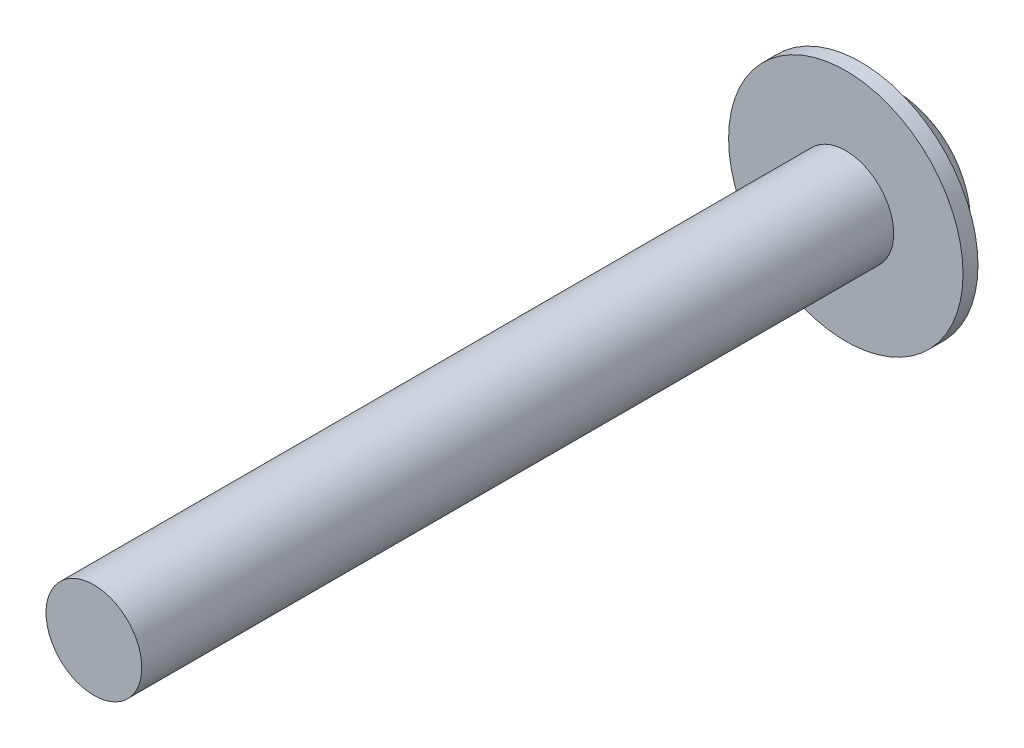
ISO-10303-21;
HEADER;
FILE_DESCRIPTION(('STEP AP214'),'2;1');
FILE_NAME('part.step','',(''),(''),'','','');
FILE_SCHEMA(('AUTOMOTIVE_DESIGN { 1 0 10303 214 1 1 1 1 }'));
ENDSEC;
DATA;
#1=APPLICATION_CONTEXT('core data for automotive mechanical design processes');
#2=APPLICATION_PROTOCOL_DEFINITION('international standard','automotive_design',2000,#1);
#3=PRODUCT_CONTEXT('',#1,'mechanical');
#4=PRODUCT('Part','Part','',(#3));
#5=PRODUCT_RELATED_PRODUCT_CATEGORY('part','',(#4));
#6=PRODUCT_DEFINITION_FORMATION('','',#4);
#7=PRODUCT_DEFINITION_CONTEXT('part definition',#1,'design');
#8=PRODUCT_DEFINITION('design','',#6,#7);
#9=PRODUCT_DEFINITION_SHAPE('','',#8);
#10=(LENGTH_UNIT() NAMED_UNIT(*) SI_UNIT(.MILLI.,.METRE.));
#11=(NAMED_UNIT(*) PLANE_ANGLE_UNIT() SI_UNIT($,.RADIAN.));
#12=(NAMED_UNIT(*) SI_UNIT($,.STERADIAN.) SOLID_ANGLE_UNIT());
#13=UNCERTAINTY_MEASURE_WITH_UNIT(LENGTH_MEASURE(1.E-05),#10,'distance_accuracy_value','');
#14=(GEOMETRIC_REPRESENTATION_CONTEXT(3) GLOBAL_UNCERTAINTY_ASSIGNED_CONTEXT((#13)) GLOBAL_UNIT_ASSIGNED_CONTEXT((#10,
#11,#12)) REPRESENTATION_CONTEXT('',''));
#15=CARTESIAN_POINT('',(0.,0.,0.));
#16=DIRECTION('',(0.,0.,1.));
#17=DIRECTION('',(1.,0.,0.));
#18=AXIS2_PLACEMENT_3D('',#15,#16,#17);
#19=CARTESIAN_POINT('',(0.,0.,-0.381));
#20=DIRECTION('',(0.,0.,-1.));
#21=DIRECTION('',(-1.,0.,0.));
#22=AXIS2_PLACEMENT_3D('',#19,#20,#21);
#23=PLANE('',#22);
#24=CARTESIAN_POINT('',(0.,0.,-0.381));
#25=DIRECTION('',(0.,0.,-1.));
#26=DIRECTION('',(-1.,0.,0.));
#27=AXIS2_PLACEMENT_3D('',#24,#25,#26);
#28=CIRCLE('',#27,2.9845);
#29=CARTESIAN_POINT('',(-2.9845,0.,-0.381));
#30=VERTEX_POINT('',#29);
#31=EDGE_CURVE('E50',#30,#30,#28,.T.);
#32=ORIENTED_EDGE('',*,*,#31,.T.);
#33=EDGE_LOOP('',(#32));
#34=FACE_BOUND('',#33,.T.);
#35=CARTESIAN_POINT('',(0.,0.,-0.381));
#36=DIRECTION('',(0.,0.,-1.));
#37=DIRECTION('',(-1.,0.,0.));
#38=AXIS2_PLACEMENT_3D('',#35,#36,#37);
#39=CIRCLE('',#38,2.2479);
#40=CARTESIAN_POINT('',(-2.2479,0.,-0.381));
#41=VERTEX_POINT('',#40);
#42=EDGE_CURVE('E54',#41,#41,#39,.T.);
#43=ORIENTED_EDGE('',*,*,#42,.F.);
#44=EDGE_LOOP('',(#43));
#45=FACE_BOUND('',#44,.T.);
#46=ADVANCED_FACE('F30',(#34,#45),#23,.T.);
#47=CARTESIAN_POINT('',(0.,0.,19.144));
#48=DIRECTION('',(0.,0.,-1.));
#49=DIRECTION('',(-1.,0.,0.));
#50=AXIS2_PLACEMENT_3D('',#47,#48,#49);
#51=CYLINDRICAL_SURFACE('',#50,1.2192);
#52=CARTESIAN_POINT('',(0.,0.,19.144));
#53=DIRECTION('',(0.,0.,1.));
#54=DIRECTION('',(1.,0.,0.));
#55=AXIS2_PLACEMENT_3D('',#52,#53,#54);
#56=CIRCLE('',#55,1.2192);
#57=CARTESIAN_POINT('',(1.2192,0.,19.144));
#58=VERTEX_POINT('',#57);
#59=EDGE_CURVE('E41',#58,#58,#56,.T.);
#60=ORIENTED_EDGE('',*,*,#59,.F.);
#61=EDGE_LOOP('',(#60));
#62=FACE_BOUND('',#61,.T.);
#63=CARTESIAN_POINT('',(0.,0.,0.));
#64=DIRECTION('',(0.,0.,-1.));
#65=DIRECTION('',(-1.,0.,0.));
#66=AXIS2_PLACEMENT_3D('',#63,#64,#65);
#67=CIRCLE('',#66,1.2192);
#68=CARTESIAN_POINT('',(-1.2192,0.,0.));
#69=VERTEX_POINT('',#68);
#70=EDGE_CURVE('E45',#69,#69,#67,.T.);
#71=ORIENTED_EDGE('',*,*,#70,.F.);
#72=EDGE_LOOP('',(#71));
#73=FACE_BOUND('',#72,.T.);
#74=ADVANCED_FACE('F63',(#62,#73),#51,.T.);
#75=CARTESIAN_POINT('',(0.,0.,19.144));
#76=DIRECTION('',(0.,0.,1.));
#77=DIRECTION('',(1.,0.,0.));
#78=AXIS2_PLACEMENT_3D('',#75,#76,#77);
#79=PLANE('',#78);
#80=ORIENTED_EDGE('',*,*,#59,.T.);
#81=EDGE_LOOP('',(#80));
#82=FACE_BOUND('',#81,.T.);
#83=ADVANCED_FACE('F69',(#82),#79,.T.);
#84=CARTESIAN_POINT('',(0.,0.,0.));
#85=DIRECTION('',(0.,0.,-1.));
#86=DIRECTION('',(-1.,0.,0.));
#87=AXIS2_PLACEMENT_3D('',#84,#85,#86);
#88=PLANE('',#87);
#89=CARTESIAN_POINT('',(0.,0.,0.));
#90=DIRECTION('',(0.,0.,-1.));
#91=DIRECTION('',(-1.,0.,0.));
#92=AXIS2_PLACEMENT_3D('',#89,#90,#91);
#93=CIRCLE('',#92,2.9845);
#94=CARTESIAN_POINT('',(-2.9845,0.,0.));
#95=VERTEX_POINT('',#94);
#96=EDGE_CURVE('E51',#95,#95,#93,.T.);
#97=ORIENTED_EDGE('',*,*,#96,.F.);
#98=EDGE_LOOP('',(#97));
#99=FACE_BOUND('',#98,.T.);
#100=ORIENTED_EDGE('',*,*,#70,.T.);
#101=EDGE_LOOP('',(#100));
#102=FACE_BOUND('',#101,.T.);
#103=ADVANCED_FACE('F74',(#99,#102),#88,.F.);
#104=CARTESIAN_POINT('',(0.,0.,-0.381));
#105=DIRECTION('',(0.,0.,1.));
#106=DIRECTION('',(1.,0.,0.));
#107=AXIS2_PLACEMENT_3D('',#104,#105,#106);
#108=CYLINDRICAL_SURFACE('',#107,2.9845);
#109=ORIENTED_EDGE('',*,*,#31,.F.);
#110=EDGE_LOOP('',(#109));
#111=FACE_BOUND('',#110,.T.);
#112=ORIENTED_EDGE('',*,*,#96,.T.);
#113=EDGE_LOOP('',(#112));
#114=FACE_BOUND('',#113,.T.);
#115=ADVANCED_FACE('F77',(#111,#114),#108,.T.);
#116=CARTESIAN_POINT('',(0.,0.,-1.524));
#117=DIRECTION('',(0.,0.,1.));
#118=DIRECTION('',(1.,0.,0.));
#119=AXIS2_PLACEMENT_3D('',#116,#117,#118);
#120=CYLINDRICAL_SURFACE('',#119,2.2479);
#121=CARTESIAN_POINT('',(0.,0.,-0.508));
#122=DIRECTION('',(0.,0.,-1.));
#123=DIRECTION('',(-1.,0.,0.));
#124=AXIS2_PLACEMENT_3D('',#121,#122,#123);
#125=CIRCLE('',#124,2.2479);
#126=CARTESIAN_POINT('',(-2.2479,0.,-0.508));
#127=VERTEX_POINT('',#126);
#128=EDGE_CURVE('E10',#127,#127,#125,.F.);
#129=ORIENTED_EDGE('',*,*,#128,.T.);
#130=EDGE_LOOP('',(#129));
#131=FACE_BOUND('',#130,.T.);
#132=ORIENTED_EDGE('',*,*,#42,.T.);
#133=EDGE_LOOP('',(#132));
#134=FACE_BOUND('',#133,.T.);
#135=ADVANCED_FACE('F60',(#131,#134),#120,.T.);
#136=CARTESIAN_POINT('',(0.,0.,-1.524));
#137=DIRECTION('',(0.,0.,-1.));
#138=DIRECTION('',(-1.,0.,0.));
#139=AXIS2_PLACEMENT_3D('',#136,#137,#138);
#140=PLANE('',#139);
#141=CARTESIAN_POINT('',(0.,0.,-1.524));
#142=DIRECTION('',(0.,0.,-1.));
#143=DIRECTION('',(-1.,0.,0.));
#144=AXIS2_PLACEMENT_3D('',#141,#142,#143);
#145=CIRCLE('',#144,1.2319);
#146=CARTESIAN_POINT('',(-1.2319,0.,-1.524));
#147=VERTEX_POINT('',#146);
#148=EDGE_CURVE('E37',#147,#147,#145,.T.);
#149=ORIENTED_EDGE('',*,*,#148,.T.);
#150=EDGE_LOOP('',(#149));
#151=FACE_BOUND('',#150,.T.);
#152=ADVANCED_FACE('F106',(#151),#140,.T.);
#153=CARTESIAN_POINT('',(0.,0.,-0.508));
#154=DIRECTION('',(0.,0.,-1.));
#155=DIRECTION('',(-1.,0.,0.));
#156=AXIS2_PLACEMENT_3D('',#153,#154,#155);
#157=TOROIDAL_SURFACE('',#156,1.2319,1.016);
#158=ORIENTED_EDGE('',*,*,#128,.F.);
#159=EDGE_LOOP('',(#158));
#160=FACE_BOUND('',#159,.T.);
#161=ORIENTED_EDGE('',*,*,#148,.F.);
#162=EDGE_LOOP('',(#161));
#163=FACE_BOUND('',#162,.T.);
#164=ADVANCED_FACE('F32',(#160,#163),#157,.T.);
#165=CLOSED_SHELL('',(#46,#74,#83,#103,#115,#135,#152,#164));
#166=MANIFOLD_SOLID_BREP('B2',#165);
#167=ADVANCED_BREP_SHAPE_REPRESENTATION('',(#18,#166),#14);
#168=SHAPE_DEFINITION_REPRESENTATION(#9,#167);
ENDSEC;
END-ISO-10303-21;
